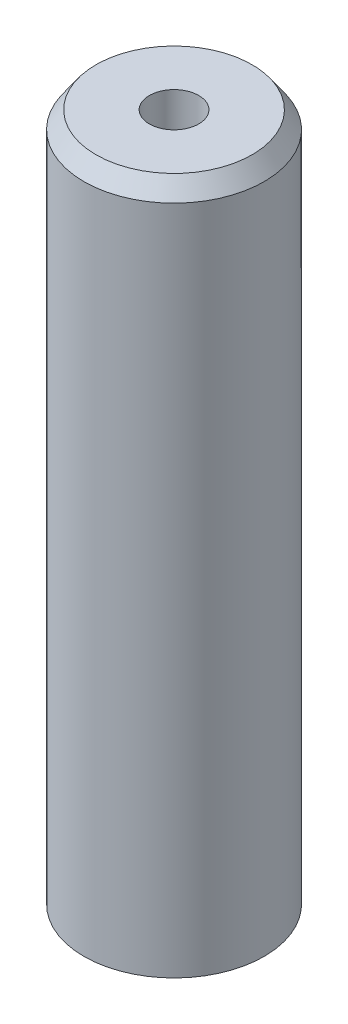
ISO-10303-21;
HEADER;
FILE_DESCRIPTION(('STEP AP214'),'2;1');
FILE_NAME('part.step','',(''),(''),'','','');
FILE_SCHEMA(('AUTOMOTIVE_DESIGN { 1 0 10303 214 1 1 1 1 }'));
ENDSEC;
DATA;
#1=APPLICATION_CONTEXT('core data for automotive mechanical design processes');
#2=APPLICATION_PROTOCOL_DEFINITION('international standard','automotive_design',2000,#1);
#3=PRODUCT_CONTEXT('',#1,'mechanical');
#4=PRODUCT('Part','Part','',(#3));
#5=PRODUCT_RELATED_PRODUCT_CATEGORY('part','',(#4));
#6=PRODUCT_DEFINITION_FORMATION('','',#4);
#7=PRODUCT_DEFINITION_CONTEXT('part definition',#1,'design');
#8=PRODUCT_DEFINITION('design','',#6,#7);
#9=PRODUCT_DEFINITION_SHAPE('','',#8);
#10=(LENGTH_UNIT() NAMED_UNIT(*) SI_UNIT(.MILLI.,.METRE.));
#11=(NAMED_UNIT(*) PLANE_ANGLE_UNIT() SI_UNIT($,.RADIAN.));
#12=(NAMED_UNIT(*) SI_UNIT($,.STERADIAN.) SOLID_ANGLE_UNIT());
#13=UNCERTAINTY_MEASURE_WITH_UNIT(LENGTH_MEASURE(1.E-05),#10,'distance_accuracy_value','');
#14=(GEOMETRIC_REPRESENTATION_CONTEXT(3) GLOBAL_UNCERTAINTY_ASSIGNED_CONTEXT((#13)) GLOBAL_UNIT_ASSIGNED_CONTEXT((#10,
#11,#12)) REPRESENTATION_CONTEXT('',''));
#15=CARTESIAN_POINT('',(0.,0.,0.));
#16=DIRECTION('',(0.,0.,1.));
#17=DIRECTION('',(1.,0.,0.));
#18=AXIS2_PLACEMENT_3D('',#15,#16,#17);
#19=CARTESIAN_POINT('',(0.,38.8417002241227,0.));
#20=DIRECTION('',(0.,-1.,0.));
#21=DIRECTION('',(0.,0.,-1.));
#22=AXIS2_PLACEMENT_3D('',#19,#20,#21);
#23=CYLINDRICAL_SURFACE('',#22,5.);
#24=CARTESIAN_POINT('',(0.,37.8879435723412,0.));
#25=DIRECTION('',(0.,1.,0.));
#26=DIRECTION('',(0.,0.,1.));
#27=AXIS2_PLACEMENT_3D('',#24,#25,#26);
#28=CIRCLE('',#27,5.);
#29=CARTESIAN_POINT('',(0.,37.8879435723412,5.));
#30=VERTEX_POINT('',#29);
#31=EDGE_CURVE('E50',#30,#30,#28,.F.);
#32=ORIENTED_EDGE('',*,*,#31,.T.);
#33=EDGE_LOOP('',(#32));
#34=FACE_BOUND('',#33,.T.);
#35=CARTESIAN_POINT('',(0.,0.670244059759191,0.));
#36=DIRECTION('',(0.,1.,0.));
#37=DIRECTION('',(0.,0.,1.));
#38=AXIS2_PLACEMENT_3D('',#35,#36,#37);
#39=CIRCLE('',#38,5.);
#40=CARTESIAN_POINT('',(0.,0.670244059759191,5.));
#41=VERTEX_POINT('',#40);
#42=EDGE_CURVE('E51',#41,#41,#39,.T.);
#43=ORIENTED_EDGE('',*,*,#42,.T.);
#44=EDGE_LOOP('',(#43));
#45=FACE_BOUND('',#44,.T.);
#46=ADVANCED_FACE('F39',(#34,#45),#23,.T.);
#47=CARTESIAN_POINT('',(0.,38.8417002241227,0.));
#48=DIRECTION('',(0.,1.,0.));
#49=DIRECTION('',(0.,0.,1.));
#50=AXIS2_PLACEMENT_3D('',#47,#48,#49);
#51=PLANE('',#50);
#52=CARTESIAN_POINT('',(0.,38.8417002241227,0.));
#53=DIRECTION('',(0.,1.,0.));
#54=DIRECTION('',(0.,0.,1.));
#55=AXIS2_PLACEMENT_3D('',#52,#53,#54);
#56=CIRCLE('',#55,4.32975594024081);
#57=CARTESIAN_POINT('',(0.,38.8417002241227,4.32975594024081));
#58=VERTEX_POINT('',#57);
#59=EDGE_CURVE('E54',#58,#58,#56,.T.);
#60=ORIENTED_EDGE('',*,*,#59,.T.);
#61=EDGE_LOOP('',(#60));
#62=FACE_BOUND('',#61,.T.);
#63=CARTESIAN_POINT('',(0.,38.8417002241227,0.));
#64=DIRECTION('',(0.,1.,0.));
#65=DIRECTION('',(0.,0.,1.));
#66=AXIS2_PLACEMENT_3D('',#63,#64,#65);
#67=CIRCLE('',#66,1.3694134987178);
#68=CARTESIAN_POINT('',(0.,38.8417002241227,1.3694134987178));
#69=VERTEX_POINT('',#68);
#70=EDGE_CURVE('E58',#69,#69,#67,.T.);
#71=ORIENTED_EDGE('',*,*,#70,.F.);
#72=EDGE_LOOP('',(#71));
#73=FACE_BOUND('',#72,.T.);
#74=ADVANCED_FACE('F69',(#62,#73),#51,.T.);
#75=CARTESIAN_POINT('',(0.,0.,0.));
#76=DIRECTION('',(0.,1.,0.));
#77=DIRECTION('',(0.,0.,1.));
#78=AXIS2_PLACEMENT_3D('',#75,#76,#77);
#79=PLANE('',#78);
#80=CARTESIAN_POINT('',(0.,0.,0.));
#81=DIRECTION('',(0.,1.,0.));
#82=DIRECTION('',(0.,0.,1.));
#83=AXIS2_PLACEMENT_3D('',#80,#81,#82);
#84=CIRCLE('',#83,4.04624334821854);
#85=CARTESIAN_POINT('',(0.,0.,4.04624334821854));
#86=VERTEX_POINT('',#85);
#87=EDGE_CURVE('E10',#86,#86,#84,.F.);
#88=ORIENTED_EDGE('',*,*,#87,.T.);
#89=EDGE_LOOP('',(#88));
#90=FACE_BOUND('',#89,.T.);
#91=CARTESIAN_POINT('',(0.,0.,0.));
#92=DIRECTION('',(0.,1.,0.));
#93=DIRECTION('',(0.,0.,1.));
#94=AXIS2_PLACEMENT_3D('',#91,#92,#93);
#95=CIRCLE('',#94,1.3694134987178);
#96=CARTESIAN_POINT('',(0.,0.,1.3694134987178));
#97=VERTEX_POINT('',#96);
#98=EDGE_CURVE('E63',#97,#97,#95,.T.);
#99=ORIENTED_EDGE('',*,*,#98,.T.);
#100=EDGE_LOOP('',(#99));
#101=FACE_BOUND('',#100,.T.);
#102=ADVANCED_FACE('F75',(#90,#101),#79,.F.);
#103=CARTESIAN_POINT('',(0.,38.8417002241227,0.));
#104=DIRECTION('',(0.,-1.,0.));
#105=DIRECTION('',(0.,0.,-1.));
#106=AXIS2_PLACEMENT_3D('',#103,#104,#105);
#107=CYLINDRICAL_SURFACE('',#106,1.3694134987178);
#108=ORIENTED_EDGE('',*,*,#70,.T.);
#109=EDGE_LOOP('',(#108));
#110=FACE_BOUND('',#109,.T.);
#111=ORIENTED_EDGE('',*,*,#98,.F.);
#112=EDGE_LOOP('',(#111));
#113=FACE_BOUND('',#112,.T.);
#114=ADVANCED_FACE('F70',(#110,#113),#107,.F.);
#115=CARTESIAN_POINT('',(0.,38.8417002241227,0.));
#116=DIRECTION('',(0.,-1.,0.));
#117=DIRECTION('',(0.,0.,-1.));
#118=AXIS2_PLACEMENT_3D('',#115,#116,#117);
#119=CONICAL_SURFACE('',#118,4.32975594024081,0.612563303664744);
#120=ORIENTED_EDGE('',*,*,#31,.F.);
#121=EDGE_LOOP('',(#120));
#122=FACE_BOUND('',#121,.T.);
#123=ORIENTED_EDGE('',*,*,#59,.F.);
#124=EDGE_LOOP('',(#123));
#125=FACE_BOUND('',#124,.T.);
#126=ADVANCED_FACE('F81',(#122,#125),#119,.T.);
#127=CARTESIAN_POINT('',(0.,0.670244059759191,0.));
#128=DIRECTION('',(0.,1.,0.));
#129=DIRECTION('',(0.,0.,1.));
#130=AXIS2_PLACEMENT_3D('',#127,#128,#129);
#131=CONICAL_SURFACE('',#130,5.,0.958233023130154);
#132=ORIENTED_EDGE('',*,*,#87,.F.);
#133=EDGE_LOOP('',(#132));
#134=FACE_BOUND('',#133,.T.);
#135=ORIENTED_EDGE('',*,*,#42,.F.);
#136=EDGE_LOOP('',(#135));
#137=FACE_BOUND('',#136,.T.);
#138=ADVANCED_FACE('F45',(#134,#137),#131,.T.);
#139=CLOSED_SHELL('',(#46,#74,#102,#114,#126,#138));
#140=MANIFOLD_SOLID_BREP('B2',#139);
#141=ADVANCED_BREP_SHAPE_REPRESENTATION('',(#18,#140),#14);
#142=SHAPE_DEFINITION_REPRESENTATION(#9,#141);
ENDSEC;
END-ISO-10303-21;
